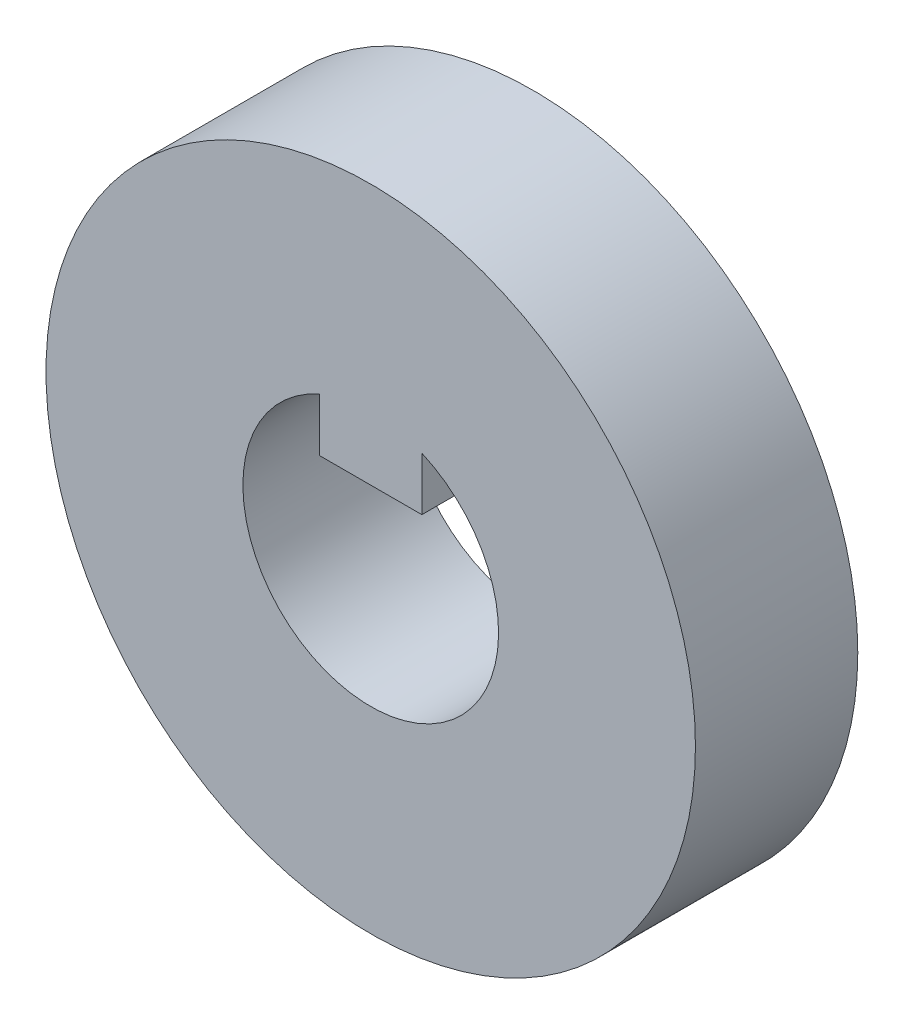
ISO-10303-21;
HEADER;
FILE_DESCRIPTION(('STEP AP214'),'2;1');
FILE_NAME('part.step','',(''),(''),'','','');
FILE_SCHEMA(('AUTOMOTIVE_DESIGN { 1 0 10303 214 1 1 1 1 }'));
ENDSEC;
DATA;
#1=APPLICATION_CONTEXT('core data for automotive mechanical design processes');
#2=APPLICATION_PROTOCOL_DEFINITION('international standard','automotive_design',2000,#1);
#3=PRODUCT_CONTEXT('',#1,'mechanical');
#4=PRODUCT('Part','Part','',(#3));
#5=PRODUCT_RELATED_PRODUCT_CATEGORY('part','',(#4));
#6=PRODUCT_DEFINITION_FORMATION('','',#4);
#7=PRODUCT_DEFINITION_CONTEXT('part definition',#1,'design');
#8=PRODUCT_DEFINITION('design','',#6,#7);
#9=PRODUCT_DEFINITION_SHAPE('','',#8);
#10=(LENGTH_UNIT() NAMED_UNIT(*) SI_UNIT(.MILLI.,.METRE.));
#11=(NAMED_UNIT(*) PLANE_ANGLE_UNIT() SI_UNIT($,.RADIAN.));
#12=(NAMED_UNIT(*) SI_UNIT($,.STERADIAN.) SOLID_ANGLE_UNIT());
#13=UNCERTAINTY_MEASURE_WITH_UNIT(LENGTH_MEASURE(1.E-05),#10,'distance_accuracy_value','');
#14=(GEOMETRIC_REPRESENTATION_CONTEXT(3) GLOBAL_UNCERTAINTY_ASSIGNED_CONTEXT((#13)) GLOBAL_UNIT_ASSIGNED_CONTEXT((#10,
#11,#12)) REPRESENTATION_CONTEXT('',''));
#15=CARTESIAN_POINT('',(0.,0.,0.));
#16=DIRECTION('',(0.,0.,1.));
#17=DIRECTION('',(1.,0.,0.));
#18=AXIS2_PLACEMENT_3D('',#15,#16,#17);
#19=CARTESIAN_POINT('',(0.,0.,12.7));
#20=DIRECTION('',(0.,0.,-1.));
#21=DIRECTION('',(-1.,0.,0.));
#22=AXIS2_PLACEMENT_3D('',#19,#20,#21);
#23=CYLINDRICAL_SURFACE('',#22,25.4);
#24=CARTESIAN_POINT('',(0.,0.,12.7));
#25=DIRECTION('',(0.,0.,1.));
#26=DIRECTION('',(1.,0.,0.));
#27=AXIS2_PLACEMENT_3D('',#24,#25,#26);
#28=CIRCLE('',#27,25.4);
#29=CARTESIAN_POINT('',(25.4,0.,12.7));
#30=VERTEX_POINT('',#29);
#31=EDGE_CURVE('E116',#30,#30,#28,.T.);
#32=ORIENTED_EDGE('',*,*,#31,.F.);
#33=EDGE_LOOP('',(#32));
#34=FACE_BOUND('',#33,.T.);
#35=CARTESIAN_POINT('',(0.,0.,0.));
#36=DIRECTION('',(0.,0.,1.));
#37=DIRECTION('',(1.,0.,0.));
#38=AXIS2_PLACEMENT_3D('',#35,#36,#37);
#39=CIRCLE('',#38,25.4);
#40=CARTESIAN_POINT('',(25.4,0.,0.));
#41=VERTEX_POINT('',#40);
#42=EDGE_CURVE('E117',#41,#41,#39,.T.);
#43=ORIENTED_EDGE('',*,*,#42,.T.);
#44=EDGE_LOOP('',(#43));
#45=FACE_BOUND('',#44,.T.);
#46=ADVANCED_FACE('F49',(#34,#45),#23,.T.);
#47=CARTESIAN_POINT('',(0.,0.,12.7));
#48=DIRECTION('',(0.,0.,-1.));
#49=DIRECTION('',(-1.,0.,0.));
#50=AXIS2_PLACEMENT_3D('',#47,#48,#49);
#51=CYLINDRICAL_SURFACE('',#50,10.);
#52=CARTESIAN_POINT('',(0.,0.,0.));
#53=DIRECTION('',(0.,0.,1.));
#54=DIRECTION('',(1.,0.,0.));
#55=AXIS2_PLACEMENT_3D('',#52,#53,#54);
#56=CIRCLE('',#55,10.);
#57=CARTESIAN_POINT('',(-4.,9.16515138991168,0.));
#58=VERTEX_POINT('',#57);
#59=CARTESIAN_POINT('',(4.,9.16515138991168,0.));
#60=VERTEX_POINT('',#59);
#61=EDGE_CURVE('E98',#58,#60,#56,.T.);
#62=ORIENTED_EDGE('',*,*,#61,.F.);
#63=DIRECTION('',(0.,0.,-1.));
#64=VECTOR('',#63,1.);
#65=CARTESIAN_POINT('',(-4.,9.16515138991168,12.7));
#66=LINE('',#65,#64);
#67=CARTESIAN_POINT('',(-4.,9.16515138991168,12.7));
#68=VERTEX_POINT('',#67);
#69=EDGE_CURVE('E12',#68,#58,#66,.T.);
#70=ORIENTED_EDGE('',*,*,#69,.F.);
#71=CARTESIAN_POINT('',(0.,0.,12.7));
#72=DIRECTION('',(0.,0.,1.));
#73=DIRECTION('',(1.,0.,0.));
#74=AXIS2_PLACEMENT_3D('',#71,#72,#73);
#75=CIRCLE('',#74,10.);
#76=CARTESIAN_POINT('',(4.,9.16515138991168,12.7));
#77=VERTEX_POINT('',#76);
#78=EDGE_CURVE('E120',#68,#77,#75,.T.);
#79=ORIENTED_EDGE('',*,*,#78,.T.);
#80=DIRECTION('',(0.,0.,-1.));
#81=VECTOR('',#80,1.);
#82=CARTESIAN_POINT('',(4.,9.16515138991168,12.7));
#83=LINE('',#82,#81);
#84=EDGE_CURVE('E59',#77,#60,#83,.T.);
#85=ORIENTED_EDGE('',*,*,#84,.T.);
#86=EDGE_LOOP('',(#62,#70,#79,#85));
#87=FACE_BOUND('',#86,.T.);
#88=ADVANCED_FACE('F127',(#87),#51,.F.);
#89=CARTESIAN_POINT('',(0.,0.,0.));
#90=DIRECTION('',(0.,0.,1.));
#91=DIRECTION('',(1.,0.,0.));
#92=AXIS2_PLACEMENT_3D('',#89,#90,#91);
#93=PLANE('',#92);
#94=DIRECTION('',(0.,-1.,0.));
#95=VECTOR('',#94,1.);
#96=CARTESIAN_POINT('',(-4.,15.,0.));
#97=LINE('',#96,#95);
#98=CARTESIAN_POINT('',(-4.,5.,0.));
#99=VERTEX_POINT('',#98);
#100=EDGE_CURVE('E85',#58,#99,#97,.T.);
#101=ORIENTED_EDGE('',*,*,#100,.F.);
#102=ORIENTED_EDGE('',*,*,#61,.T.);
#103=DIRECTION('',(0.,-1.,0.));
#104=VECTOR('',#103,1.);
#105=CARTESIAN_POINT('',(4.,15.,0.));
#106=LINE('',#105,#104);
#107=CARTESIAN_POINT('',(4.,5.,0.));
#108=VERTEX_POINT('',#107);
#109=EDGE_CURVE('E91',#60,#108,#106,.T.);
#110=ORIENTED_EDGE('',*,*,#109,.T.);
#111=DIRECTION('',(-1.,0.,0.));
#112=VECTOR('',#111,1.);
#113=CARTESIAN_POINT('',(4.,5.,0.));
#114=LINE('',#113,#112);
#115=EDGE_CURVE('E96',#108,#99,#114,.T.);
#116=ORIENTED_EDGE('',*,*,#115,.T.);
#117=EDGE_LOOP('',(#101,#102,#110,#116));
#118=FACE_BOUND('',#117,.T.);
#119=ORIENTED_EDGE('',*,*,#42,.F.);
#120=EDGE_LOOP('',(#119));
#121=FACE_BOUND('',#120,.T.);
#122=ADVANCED_FACE('F93',(#118,#121),#93,.F.);
#123=CARTESIAN_POINT('',(0.,0.,12.7));
#124=DIRECTION('',(0.,0.,1.));
#125=DIRECTION('',(1.,0.,0.));
#126=AXIS2_PLACEMENT_3D('',#123,#124,#125);
#127=PLANE('',#126);
#128=ORIENTED_EDGE('',*,*,#78,.F.);
#129=DIRECTION('',(0.,-1.,0.));
#130=VECTOR('',#129,1.);
#131=CARTESIAN_POINT('',(-4.,15.,12.7));
#132=LINE('',#131,#130);
#133=CARTESIAN_POINT('',(-4.,5.,12.7));
#134=VERTEX_POINT('',#133);
#135=EDGE_CURVE('E112',#68,#134,#132,.T.);
#136=ORIENTED_EDGE('',*,*,#135,.T.);
#137=DIRECTION('',(-1.,0.,0.));
#138=VECTOR('',#137,1.);
#139=CARTESIAN_POINT('',(4.,5.,12.7));
#140=LINE('',#139,#138);
#141=CARTESIAN_POINT('',(4.,5.,12.7));
#142=VERTEX_POINT('',#141);
#143=EDGE_CURVE('E99',#142,#134,#140,.T.);
#144=ORIENTED_EDGE('',*,*,#143,.F.);
#145=DIRECTION('',(0.,-1.,0.));
#146=VECTOR('',#145,1.);
#147=CARTESIAN_POINT('',(4.,15.,12.7));
#148=LINE('',#147,#146);
#149=EDGE_CURVE('E104',#77,#142,#148,.T.);
#150=ORIENTED_EDGE('',*,*,#149,.F.);
#151=EDGE_LOOP('',(#128,#136,#144,#150));
#152=FACE_BOUND('',#151,.T.);
#153=ORIENTED_EDGE('',*,*,#31,.T.);
#154=EDGE_LOOP('',(#153));
#155=FACE_BOUND('',#154,.T.);
#156=ADVANCED_FACE('F130',(#152,#155),#127,.T.);
#157=CARTESIAN_POINT('',(4.,15.,12.7));
#158=DIRECTION('',(1.,0.,0.));
#159=DIRECTION('',(0.,1.,0.));
#160=AXIS2_PLACEMENT_3D('',#157,#158,#159);
#161=PLANE('',#160);
#162=ORIENTED_EDGE('',*,*,#109,.F.);
#163=ORIENTED_EDGE('',*,*,#84,.F.);
#164=ORIENTED_EDGE('',*,*,#149,.T.);
#165=DIRECTION('',(0.,0.,-1.));
#166=VECTOR('',#165,1.);
#167=CARTESIAN_POINT('',(4.,5.,12.7));
#168=LINE('',#167,#166);
#169=EDGE_CURVE('E102',#142,#108,#168,.T.);
#170=ORIENTED_EDGE('',*,*,#169,.T.);
#171=EDGE_LOOP('',(#162,#163,#164,#170));
#172=FACE_BOUND('',#171,.T.);
#173=ADVANCED_FACE('F103',(#172),#161,.T.);
#174=CARTESIAN_POINT('',(-4.,15.,12.7));
#175=DIRECTION('',(1.,0.,0.));
#176=DIRECTION('',(0.,1.,0.));
#177=AXIS2_PLACEMENT_3D('',#174,#175,#176);
#178=PLANE('',#177);
#179=ORIENTED_EDGE('',*,*,#69,.T.);
#180=ORIENTED_EDGE('',*,*,#100,.T.);
#181=DIRECTION('',(0.,0.,-1.));
#182=VECTOR('',#181,1.);
#183=CARTESIAN_POINT('',(-4.,5.,12.7));
#184=LINE('',#183,#182);
#185=EDGE_CURVE('E53',#134,#99,#184,.T.);
#186=ORIENTED_EDGE('',*,*,#185,.F.);
#187=ORIENTED_EDGE('',*,*,#135,.F.);
#188=EDGE_LOOP('',(#179,#180,#186,#187));
#189=FACE_BOUND('',#188,.T.);
#190=ADVANCED_FACE('F132',(#189),#178,.F.);
#191=CARTESIAN_POINT('',(4.,5.,12.7));
#192=DIRECTION('',(0.,-1.,0.));
#193=DIRECTION('',(1.,0.,0.));
#194=AXIS2_PLACEMENT_3D('',#191,#192,#193);
#195=PLANE('',#194);
#196=ORIENTED_EDGE('',*,*,#115,.F.);
#197=ORIENTED_EDGE('',*,*,#169,.F.);
#198=ORIENTED_EDGE('',*,*,#143,.T.);
#199=ORIENTED_EDGE('',*,*,#185,.T.);
#200=EDGE_LOOP('',(#196,#197,#198,#199));
#201=FACE_BOUND('',#200,.T.);
#202=ADVANCED_FACE('F51',(#201),#195,.T.);
#203=CLOSED_SHELL('',(#46,#88,#122,#156,#173,#190,#202));
#204=MANIFOLD_SOLID_BREP('B2',#203);
#205=ADVANCED_BREP_SHAPE_REPRESENTATION('',(#18,#204),#14);
#206=SHAPE_DEFINITION_REPRESENTATION(#9,#205);
ENDSEC;
END-ISO-10303-21;
